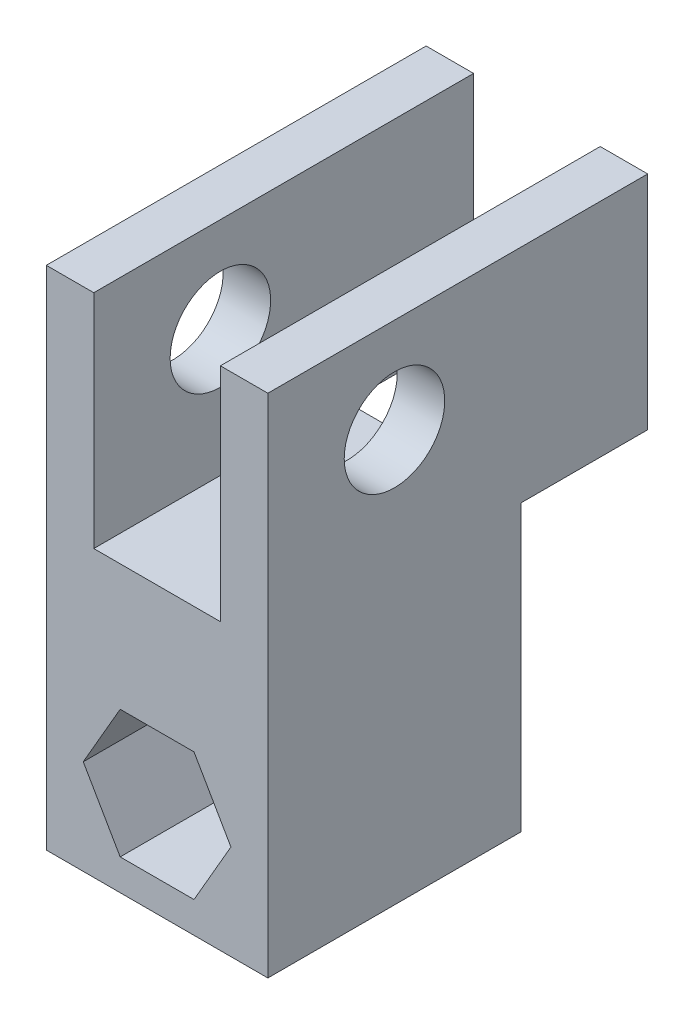
ISO-10303-21;
HEADER;
FILE_DESCRIPTION(('STEP AP214'),'2;1');
FILE_NAME('part.step','',(''),(''),'','','');
FILE_SCHEMA(('AUTOMOTIVE_DESIGN { 1 0 10303 214 1 1 1 1 }'));
ENDSEC;
DATA;
#1=APPLICATION_CONTEXT('core data for automotive mechanical design processes');
#2=APPLICATION_PROTOCOL_DEFINITION('international standard','automotive_design',2000,#1);
#3=PRODUCT_CONTEXT('',#1,'mechanical');
#4=PRODUCT('Part','Part','',(#3));
#5=PRODUCT_RELATED_PRODUCT_CATEGORY('part','',(#4));
#6=PRODUCT_DEFINITION_FORMATION('','',#4);
#7=PRODUCT_DEFINITION_CONTEXT('part definition',#1,'design');
#8=PRODUCT_DEFINITION('design','',#6,#7);
#9=PRODUCT_DEFINITION_SHAPE('','',#8);
#10=(LENGTH_UNIT() NAMED_UNIT(*) SI_UNIT(.MILLI.,.METRE.));
#11=(NAMED_UNIT(*) PLANE_ANGLE_UNIT() SI_UNIT($,.RADIAN.));
#12=(NAMED_UNIT(*) SI_UNIT($,.STERADIAN.) SOLID_ANGLE_UNIT());
#13=UNCERTAINTY_MEASURE_WITH_UNIT(LENGTH_MEASURE(1.E-05),#10,'distance_accuracy_value','');
#14=(GEOMETRIC_REPRESENTATION_CONTEXT(3) GLOBAL_UNCERTAINTY_ASSIGNED_CONTEXT((#13)) GLOBAL_UNIT_ASSIGNED_CONTEXT((#10,
#11,#12)) REPRESENTATION_CONTEXT('',''));
#15=CARTESIAN_POINT('',(0.,0.,0.));
#16=DIRECTION('',(0.,0.,1.));
#17=DIRECTION('',(1.,0.,0.));
#18=AXIS2_PLACEMENT_3D('',#15,#16,#17);
#19=CARTESIAN_POINT('',(0.,0.,0.));
#20=DIRECTION('',(0.,0.,1.));
#21=DIRECTION('',(1.,0.,0.));
#22=AXIS2_PLACEMENT_3D('',#19,#20,#21);
#23=PLANE('',#22);
#24=DIRECTION('',(0.5,0.866025403784439,0.));
#25=VECTOR('',#24,1.);
#26=CARTESIAN_POINT('',(3.70283595144767,3.11150000000001,0.));
#27=LINE('',#26,#25);
#28=CARTESIAN_POINT('',(3.70283595144767,3.11150000000001,0.));
#29=VERTEX_POINT('',#28);
#30=CARTESIAN_POINT('',(7.40567190289534,9.525,0.));
#31=VERTEX_POINT('',#30);
#32=EDGE_CURVE('E289',#29,#31,#27,.T.);
#33=ORIENTED_EDGE('',*,*,#32,.T.);
#34=DIRECTION('',(-0.5,0.866025403784439,0.));
#35=VECTOR('',#34,1.);
#36=CARTESIAN_POINT('',(7.40567190289534,9.525,0.));
#37=LINE('',#36,#35);
#38=CARTESIAN_POINT('',(3.70283595144767,15.9385,0.));
#39=VERTEX_POINT('',#38);
#40=EDGE_CURVE('E268',#31,#39,#37,.T.);
#41=ORIENTED_EDGE('',*,*,#40,.T.);
#42=DIRECTION('',(-1.,0.,0.));
#43=VECTOR('',#42,1.);
#44=CARTESIAN_POINT('',(3.70283595144767,15.9385,0.));
#45=LINE('',#44,#43);
#46=CARTESIAN_POINT('',(-3.70283595144766,15.9385,0.));
#47=VERTEX_POINT('',#46);
#48=EDGE_CURVE('E272',#39,#47,#45,.T.);
#49=ORIENTED_EDGE('',*,*,#48,.T.);
#50=DIRECTION('',(-0.5,-0.866025403784439,0.));
#51=VECTOR('',#50,1.);
#52=CARTESIAN_POINT('',(-3.70283595144766,15.9385,0.));
#53=LINE('',#52,#51);
#54=CARTESIAN_POINT('',(-7.40567190289533,9.525,0.));
#55=VERTEX_POINT('',#54);
#56=EDGE_CURVE('E277',#47,#55,#53,.T.);
#57=ORIENTED_EDGE('',*,*,#56,.T.);
#58=DIRECTION('',(0.5,-0.866025403784439,0.));
#59=VECTOR('',#58,1.);
#60=CARTESIAN_POINT('',(-7.40567190289533,9.525,0.));
#61=LINE('',#60,#59);
#62=CARTESIAN_POINT('',(-3.70283595144766,3.1115,0.));
#63=VERTEX_POINT('',#62);
#64=EDGE_CURVE('E281',#55,#63,#61,.T.);
#65=ORIENTED_EDGE('',*,*,#64,.T.);
#66=DIRECTION('',(1.,0.,0.));
#67=VECTOR('',#66,1.);
#68=CARTESIAN_POINT('',(-3.70283595144766,3.1115,0.));
#69=LINE('',#68,#67);
#70=EDGE_CURVE('E285',#63,#29,#69,.T.);
#71=ORIENTED_EDGE('',*,*,#70,.T.);
#72=EDGE_LOOP('',(#33,#41,#49,#57,#65,#71));
#73=FACE_BOUND('',#72,.T.);
#74=DIRECTION('',(-1.,0.,0.));
#75=VECTOR('',#74,1.);
#76=CARTESIAN_POINT('',(11.1125,28.575,0.));
#77=LINE('',#76,#75);
#78=CARTESIAN_POINT('',(11.1125,28.575,0.));
#79=VERTEX_POINT('',#78);
#80=CARTESIAN_POINT('',(6.35,28.575,0.));
#81=VERTEX_POINT('',#80);
#82=EDGE_CURVE('E64',#79,#81,#77,.T.);
#83=ORIENTED_EDGE('',*,*,#82,.F.);
#84=DIRECTION('',(0.,1.,0.));
#85=VECTOR('',#84,1.);
#86=CARTESIAN_POINT('',(11.1125,50.8,0.));
#87=LINE('',#86,#85);
#88=CARTESIAN_POINT('',(11.1125,0.,0.));
#89=VERTEX_POINT('',#88);
#90=EDGE_CURVE('E223',#89,#79,#87,.T.);
#91=ORIENTED_EDGE('',*,*,#90,.F.);
#92=DIRECTION('',(1.,0.,0.));
#93=VECTOR('',#92,1.);
#94=CARTESIAN_POINT('',(-11.1125,0.,0.));
#95=LINE('',#94,#93);
#96=CARTESIAN_POINT('',(-11.1125,0.,0.));
#97=VERTEX_POINT('',#96);
#98=EDGE_CURVE('E337',#97,#89,#95,.T.);
#99=ORIENTED_EDGE('',*,*,#98,.F.);
#100=DIRECTION('',(0.,-1.,0.));
#101=VECTOR('',#100,1.);
#102=CARTESIAN_POINT('',(-11.1125,0.,0.));
#103=LINE('',#102,#101);
#104=CARTESIAN_POINT('',(-11.1125,28.575,0.));
#105=VERTEX_POINT('',#104);
#106=EDGE_CURVE('E364',#105,#97,#103,.T.);
#107=ORIENTED_EDGE('',*,*,#106,.F.);
#108=DIRECTION('',(-1.,0.,0.));
#109=VECTOR('',#108,1.);
#110=CARTESIAN_POINT('',(-11.1125,28.575,0.));
#111=LINE('',#110,#109);
#112=CARTESIAN_POINT('',(-6.35000000000001,28.575,0.));
#113=VERTEX_POINT('',#112);
#114=EDGE_CURVE('E245',#113,#105,#111,.T.);
#115=ORIENTED_EDGE('',*,*,#114,.F.);
#116=DIRECTION('',(-1.,0.,0.));
#117=VECTOR('',#116,1.);
#118=CARTESIAN_POINT('',(-6.35000000000001,28.575,0.));
#119=LINE('',#118,#117);
#120=EDGE_CURVE('E360',#81,#113,#119,.T.);
#121=ORIENTED_EDGE('',*,*,#120,.F.);
#122=EDGE_LOOP('',(#83,#91,#99,#107,#115,#121));
#123=FACE_BOUND('',#122,.T.);
#124=ADVANCED_FACE('F47',(#73,#123),#23,.F.);
#125=CARTESIAN_POINT('',(11.1125,50.8,25.4));
#126=DIRECTION('',(-1.,0.,0.));
#127=DIRECTION('',(0.,-1.,0.));
#128=AXIS2_PLACEMENT_3D('',#125,#126,#127);
#129=PLANE('',#128);
#130=CARTESIAN_POINT('',(11.1125,41.275,12.7));
#131=DIRECTION('',(-1.,0.,0.));
#132=DIRECTION('',(0.,0.,1.));
#133=AXIS2_PLACEMENT_3D('',#130,#131,#132);
#134=CIRCLE('',#133,5.04189999999999);
#135=CARTESIAN_POINT('',(11.1125,41.275,17.7419));
#136=VERTEX_POINT('',#135);
#137=EDGE_CURVE('E230',#136,#136,#134,.T.);
#138=ORIENTED_EDGE('',*,*,#137,.T.);
#139=EDGE_LOOP('',(#138));
#140=FACE_BOUND('',#139,.T.);
#141=ORIENTED_EDGE('',*,*,#90,.T.);
#142=DIRECTION('',(0.,0.,1.));
#143=VECTOR('',#142,1.);
#144=CARTESIAN_POINT('',(11.1125,28.575,-12.7));
#145=LINE('',#144,#143);
#146=CARTESIAN_POINT('',(11.1125,28.575,-12.7));
#147=VERTEX_POINT('',#146);
#148=EDGE_CURVE('E203',#147,#79,#145,.T.);
#149=ORIENTED_EDGE('',*,*,#148,.F.);
#150=DIRECTION('',(0.,-1.,0.));
#151=VECTOR('',#150,1.);
#152=CARTESIAN_POINT('',(11.1125,50.8,-12.7));
#153=LINE('',#152,#151);
#154=CARTESIAN_POINT('',(11.1125,50.8,-12.7));
#155=VERTEX_POINT('',#154);
#156=EDGE_CURVE('E211',#155,#147,#153,.T.);
#157=ORIENTED_EDGE('',*,*,#156,.F.);
#158=DIRECTION('',(0.,0.,-1.));
#159=VECTOR('',#158,1.);
#160=CARTESIAN_POINT('',(11.1125,50.8,25.4));
#161=LINE('',#160,#159);
#162=CARTESIAN_POINT('',(11.1125,50.8,25.4));
#163=VERTEX_POINT('',#162);
#164=EDGE_CURVE('E11',#163,#155,#161,.T.);
#165=ORIENTED_EDGE('',*,*,#164,.F.);
#166=DIRECTION('',(0.,1.,0.));
#167=VECTOR('',#166,1.);
#168=CARTESIAN_POINT('',(11.1125,50.8,25.4));
#169=LINE('',#168,#167);
#170=CARTESIAN_POINT('',(11.1125,0.,25.4));
#171=VERTEX_POINT('',#170);
#172=EDGE_CURVE('E332',#171,#163,#169,.T.);
#173=ORIENTED_EDGE('',*,*,#172,.F.);
#174=DIRECTION('',(0.,0.,-1.));
#175=VECTOR('',#174,1.);
#176=CARTESIAN_POINT('',(11.1125,0.,25.4));
#177=LINE('',#176,#175);
#178=EDGE_CURVE('E358',#171,#89,#177,.T.);
#179=ORIENTED_EDGE('',*,*,#178,.T.);
#180=EDGE_LOOP('',(#141,#149,#157,#165,#173,#179));
#181=FACE_BOUND('',#180,.T.);
#182=ADVANCED_FACE('F49',(#140,#181),#129,.F.);
#183=CARTESIAN_POINT('',(6.34999999999999,50.8,25.4));
#184=DIRECTION('',(0.,-1.,0.));
#185=DIRECTION('',(1.,0.,0.));
#186=AXIS2_PLACEMENT_3D('',#183,#184,#185);
#187=PLANE('',#186);
#188=ORIENTED_EDGE('',*,*,#164,.T.);
#189=DIRECTION('',(1.,0.,0.));
#190=VECTOR('',#189,1.);
#191=CARTESIAN_POINT('',(11.1125,50.8,-12.7));
#192=LINE('',#191,#190);
#193=CARTESIAN_POINT('',(6.35,50.8,-12.7));
#194=VERTEX_POINT('',#193);
#195=EDGE_CURVE('E217',#194,#155,#192,.T.);
#196=ORIENTED_EDGE('',*,*,#195,.F.);
#197=DIRECTION('',(0.,0.,-1.));
#198=VECTOR('',#197,1.);
#199=CARTESIAN_POINT('',(6.34999999999999,50.8,25.4));
#200=LINE('',#199,#198);
#201=CARTESIAN_POINT('',(6.34999999999999,50.8,25.4));
#202=VERTEX_POINT('',#201);
#203=EDGE_CURVE('E57',#202,#194,#200,.T.);
#204=ORIENTED_EDGE('',*,*,#203,.F.);
#205=DIRECTION('',(-1.,0.,0.));
#206=VECTOR('',#205,1.);
#207=CARTESIAN_POINT('',(6.34999999999999,50.8,25.4));
#208=LINE('',#207,#206);
#209=EDGE_CURVE('E336',#163,#202,#208,.T.);
#210=ORIENTED_EDGE('',*,*,#209,.F.);
#211=EDGE_LOOP('',(#188,#196,#204,#210));
#212=FACE_BOUND('',#211,.T.);
#213=ADVANCED_FACE('F398',(#212),#187,.F.);
#214=CARTESIAN_POINT('',(6.35,28.575,25.4));
#215=DIRECTION('',(1.,0.,0.));
#216=DIRECTION('',(0.,1.,0.));
#217=AXIS2_PLACEMENT_3D('',#214,#215,#216);
#218=PLANE('',#217);
#219=CARTESIAN_POINT('',(6.35,41.275,12.7));
#220=DIRECTION('',(1.,0.,0.));
#221=DIRECTION('',(0.,1.,0.));
#222=AXIS2_PLACEMENT_3D('',#219,#220,#221);
#223=CIRCLE('',#222,5.0419);
#224=CARTESIAN_POINT('',(6.35,46.3169,12.7));
#225=VERTEX_POINT('',#224);
#226=EDGE_CURVE('E264',#225,#225,#223,.T.);
#227=ORIENTED_EDGE('',*,*,#226,.T.);
#228=EDGE_LOOP('',(#227));
#229=FACE_BOUND('',#228,.T.);
#230=ORIENTED_EDGE('',*,*,#203,.T.);
#231=DIRECTION('',(0.,1.,0.));
#232=VECTOR('',#231,1.);
#233=CARTESIAN_POINT('',(6.35,50.8,-12.7));
#234=LINE('',#233,#232);
#235=CARTESIAN_POINT('',(6.35,28.575,-12.7));
#236=VERTEX_POINT('',#235);
#237=EDGE_CURVE('E210',#236,#194,#234,.T.);
#238=ORIENTED_EDGE('',*,*,#237,.F.);
#239=DIRECTION('',(0.,0.,1.));
#240=VECTOR('',#239,1.);
#241=CARTESIAN_POINT('',(6.35,28.575,-12.7));
#242=LINE('',#241,#240);
#243=EDGE_CURVE('E205',#236,#81,#242,.T.);
#244=ORIENTED_EDGE('',*,*,#243,.T.);
#245=DIRECTION('',(0.,0.,-1.));
#246=VECTOR('',#245,1.);
#247=CARTESIAN_POINT('',(6.35,28.575,25.4));
#248=LINE('',#247,#246);
#249=CARTESIAN_POINT('',(6.35,28.575,25.4));
#250=VERTEX_POINT('',#249);
#251=EDGE_CURVE('E385',#250,#81,#248,.T.);
#252=ORIENTED_EDGE('',*,*,#251,.F.);
#253=DIRECTION('',(0.,-1.,0.));
#254=VECTOR('',#253,1.);
#255=CARTESIAN_POINT('',(6.35,28.575,25.4));
#256=LINE('',#255,#254);
#257=EDGE_CURVE('E340',#202,#250,#256,.T.);
#258=ORIENTED_EDGE('',*,*,#257,.F.);
#259=EDGE_LOOP('',(#230,#238,#244,#252,#258));
#260=FACE_BOUND('',#259,.T.);
#261=ADVANCED_FACE('F393',(#229,#260),#218,.F.);
#262=CARTESIAN_POINT('',(-6.35000000000001,28.575,25.4));
#263=DIRECTION('',(0.,-1.,0.));
#264=DIRECTION('',(1.,0.,0.));
#265=AXIS2_PLACEMENT_3D('',#262,#263,#264);
#266=PLANE('',#265);
#267=ORIENTED_EDGE('',*,*,#120,.T.);
#268=DIRECTION('',(0.,0.,-1.));
#269=VECTOR('',#268,1.);
#270=CARTESIAN_POINT('',(-6.35000000000001,28.575,25.4));
#271=LINE('',#270,#269);
#272=CARTESIAN_POINT('',(-6.35000000000001,28.575,25.4));
#273=VERTEX_POINT('',#272);
#274=EDGE_CURVE('E381',#273,#113,#271,.T.);
#275=ORIENTED_EDGE('',*,*,#274,.F.);
#276=DIRECTION('',(-1.,0.,0.));
#277=VECTOR('',#276,1.);
#278=CARTESIAN_POINT('',(-6.35000000000001,28.575,25.4));
#279=LINE('',#278,#277);
#280=EDGE_CURVE('E343',#250,#273,#279,.T.);
#281=ORIENTED_EDGE('',*,*,#280,.F.);
#282=ORIENTED_EDGE('',*,*,#251,.T.);
#283=EDGE_LOOP('',(#267,#275,#281,#282));
#284=FACE_BOUND('',#283,.T.);
#285=ADVANCED_FACE('F405',(#284),#266,.F.);
#286=CARTESIAN_POINT('',(-6.35000000000001,50.8,25.4));
#287=DIRECTION('',(-1.,0.,0.));
#288=DIRECTION('',(0.,-1.,0.));
#289=AXIS2_PLACEMENT_3D('',#286,#287,#288);
#290=PLANE('',#289);
#291=CARTESIAN_POINT('',(-6.35000000000001,41.275,12.7));
#292=DIRECTION('',(-1.,0.,0.));
#293=DIRECTION('',(0.,-1.,0.));
#294=AXIS2_PLACEMENT_3D('',#291,#292,#293);
#295=CIRCLE('',#294,5.0419);
#296=CARTESIAN_POINT('',(-6.35000000000001,36.2331,12.7));
#297=VERTEX_POINT('',#296);
#298=EDGE_CURVE('E51',#297,#297,#295,.T.);
#299=ORIENTED_EDGE('',*,*,#298,.T.);
#300=EDGE_LOOP('',(#299));
#301=FACE_BOUND('',#300,.T.);
#302=ORIENTED_EDGE('',*,*,#274,.T.);
#303=DIRECTION('',(0.,0.,1.));
#304=VECTOR('',#303,1.);
#305=CARTESIAN_POINT('',(-6.35000000000001,28.575,-12.7));
#306=LINE('',#305,#304);
#307=CARTESIAN_POINT('',(-6.35000000000001,28.575,-12.7));
#308=VERTEX_POINT('',#307);
#309=EDGE_CURVE('E236',#308,#113,#306,.T.);
#310=ORIENTED_EDGE('',*,*,#309,.F.);
#311=DIRECTION('',(0.,-1.,0.));
#312=VECTOR('',#311,1.);
#313=CARTESIAN_POINT('',(-6.35,50.8,-12.7));
#314=LINE('',#313,#312);
#315=CARTESIAN_POINT('',(-6.35,50.8,-12.7));
#316=VERTEX_POINT('',#315);
#317=EDGE_CURVE('E251',#316,#308,#314,.T.);
#318=ORIENTED_EDGE('',*,*,#317,.F.);
#319=DIRECTION('',(0.,0.,-1.));
#320=VECTOR('',#319,1.);
#321=CARTESIAN_POINT('',(-6.35000000000001,50.8,25.4));
#322=LINE('',#321,#320);
#323=CARTESIAN_POINT('',(-6.35000000000001,50.8,25.4));
#324=VERTEX_POINT('',#323);
#325=EDGE_CURVE('E378',#324,#316,#322,.T.);
#326=ORIENTED_EDGE('',*,*,#325,.F.);
#327=DIRECTION('',(0.,1.,0.));
#328=VECTOR('',#327,1.);
#329=CARTESIAN_POINT('',(-6.35000000000001,50.8,25.4));
#330=LINE('',#329,#328);
#331=EDGE_CURVE('E346',#273,#324,#330,.T.);
#332=ORIENTED_EDGE('',*,*,#331,.F.);
#333=EDGE_LOOP('',(#302,#310,#318,#326,#332));
#334=FACE_BOUND('',#333,.T.);
#335=ADVANCED_FACE('F427',(#301,#334),#290,.F.);
#336=CARTESIAN_POINT('',(-11.1125,50.8,25.4));
#337=DIRECTION('',(0.,-1.,0.));
#338=DIRECTION('',(0.,0.,-1.));
#339=AXIS2_PLACEMENT_3D('',#336,#337,#338);
#340=PLANE('',#339);
#341=ORIENTED_EDGE('',*,*,#325,.T.);
#342=DIRECTION('',(1.,0.,0.));
#343=VECTOR('',#342,1.);
#344=CARTESIAN_POINT('',(-11.1125,50.8,-12.7));
#345=LINE('',#344,#343);
#346=CARTESIAN_POINT('',(-11.1125,50.8,-12.7));
#347=VERTEX_POINT('',#346);
#348=EDGE_CURVE('E254',#347,#316,#345,.T.);
#349=ORIENTED_EDGE('',*,*,#348,.F.);
#350=DIRECTION('',(0.,0.,-1.));
#351=VECTOR('',#350,1.);
#352=CARTESIAN_POINT('',(-11.1125,50.8,25.4));
#353=LINE('',#352,#351);
#354=CARTESIAN_POINT('',(-11.1125,50.8,25.4));
#355=VERTEX_POINT('',#354);
#356=EDGE_CURVE('E375',#355,#347,#353,.T.);
#357=ORIENTED_EDGE('',*,*,#356,.F.);
#358=DIRECTION('',(-1.,0.,0.));
#359=VECTOR('',#358,1.);
#360=CARTESIAN_POINT('',(-11.1125,50.8,25.4));
#361=LINE('',#360,#359);
#362=EDGE_CURVE('E349',#324,#355,#361,.T.);
#363=ORIENTED_EDGE('',*,*,#362,.F.);
#364=EDGE_LOOP('',(#341,#349,#357,#363));
#365=FACE_BOUND('',#364,.T.);
#366=ADVANCED_FACE('F433',(#365),#340,.F.);
#367=CARTESIAN_POINT('',(-11.1125,0.,25.4));
#368=DIRECTION('',(1.,0.,0.));
#369=DIRECTION('',(0.,0.,-1.));
#370=AXIS2_PLACEMENT_3D('',#367,#368,#369);
#371=PLANE('',#370);
#372=CARTESIAN_POINT('',(-11.1125,41.275,12.7));
#373=DIRECTION('',(-1.,0.,0.));
#374=DIRECTION('',(0.,0.,1.));
#375=AXIS2_PLACEMENT_3D('',#372,#373,#374);
#376=CIRCLE('',#375,5.0419);
#377=CARTESIAN_POINT('',(-11.1125,41.275,17.7419));
#378=VERTEX_POINT('',#377);
#379=EDGE_CURVE('E225',#378,#378,#376,.T.);
#380=ORIENTED_EDGE('',*,*,#379,.F.);
#381=EDGE_LOOP('',(#380));
#382=FACE_BOUND('',#381,.T.);
#383=ORIENTED_EDGE('',*,*,#356,.T.);
#384=DIRECTION('',(0.,1.,0.));
#385=VECTOR('',#384,1.);
#386=CARTESIAN_POINT('',(-11.1125,50.8,-12.7));
#387=LINE('',#386,#385);
#388=CARTESIAN_POINT('',(-11.1125,28.575,-12.7));
#389=VERTEX_POINT('',#388);
#390=EDGE_CURVE('E248',#389,#347,#387,.T.);
#391=ORIENTED_EDGE('',*,*,#390,.F.);
#392=DIRECTION('',(0.,0.,1.));
#393=VECTOR('',#392,1.);
#394=CARTESIAN_POINT('',(-11.1125,28.575,-12.7));
#395=LINE('',#394,#393);
#396=EDGE_CURVE('E240',#389,#105,#395,.T.);
#397=ORIENTED_EDGE('',*,*,#396,.T.);
#398=ORIENTED_EDGE('',*,*,#106,.T.);
#399=DIRECTION('',(0.,0.,-1.));
#400=VECTOR('',#399,1.);
#401=CARTESIAN_POINT('',(-11.1125,0.,25.4));
#402=LINE('',#401,#400);
#403=CARTESIAN_POINT('',(-11.1125,0.,25.4));
#404=VERTEX_POINT('',#403);
#405=EDGE_CURVE('E371',#404,#97,#402,.T.);
#406=ORIENTED_EDGE('',*,*,#405,.F.);
#407=DIRECTION('',(0.,-1.,0.));
#408=VECTOR('',#407,1.);
#409=CARTESIAN_POINT('',(-11.1125,0.,25.4));
#410=LINE('',#409,#408);
#411=EDGE_CURVE('E352',#355,#404,#410,.T.);
#412=ORIENTED_EDGE('',*,*,#411,.F.);
#413=EDGE_LOOP('',(#383,#391,#397,#398,#406,#412));
#414=FACE_BOUND('',#413,.T.);
#415=ADVANCED_FACE('F419',(#382,#414),#371,.F.);
#416=CARTESIAN_POINT('',(-11.1125,0.,25.4));
#417=DIRECTION('',(0.,1.,0.));
#418=DIRECTION('',(-1.,0.,0.));
#419=AXIS2_PLACEMENT_3D('',#416,#417,#418);
#420=PLANE('',#419);
#421=ORIENTED_EDGE('',*,*,#98,.T.);
#422=ORIENTED_EDGE('',*,*,#178,.F.);
#423=DIRECTION('',(1.,0.,0.));
#424=VECTOR('',#423,1.);
#425=CARTESIAN_POINT('',(-11.1125,0.,25.4));
#426=LINE('',#425,#424);
#427=EDGE_CURVE('E355',#404,#171,#426,.T.);
#428=ORIENTED_EDGE('',*,*,#427,.F.);
#429=ORIENTED_EDGE('',*,*,#405,.T.);
#430=EDGE_LOOP('',(#421,#422,#428,#429));
#431=FACE_BOUND('',#430,.T.);
#432=ADVANCED_FACE('F415',(#431),#420,.F.);
#433=CARTESIAN_POINT('',(0.,0.,25.4));
#434=DIRECTION('',(0.,0.,1.));
#435=DIRECTION('',(1.,0.,0.));
#436=AXIS2_PLACEMENT_3D('',#433,#434,#435);
#437=PLANE('',#436);
#438=DIRECTION('',(-0.5,0.866025403784439,0.));
#439=VECTOR('',#438,1.);
#440=CARTESIAN_POINT('',(7.40567190289534,9.525,25.4));
#441=LINE('',#440,#439);
#442=CARTESIAN_POINT('',(7.40567190289534,9.525,25.4));
#443=VERTEX_POINT('',#442);
#444=CARTESIAN_POINT('',(3.70283595144767,15.9385,25.4));
#445=VERTEX_POINT('',#444);
#446=EDGE_CURVE('E75',#443,#445,#441,.T.);
#447=ORIENTED_EDGE('',*,*,#446,.F.);
#448=DIRECTION('',(0.5,0.866025403784439,0.));
#449=VECTOR('',#448,1.);
#450=CARTESIAN_POINT('',(3.70283595144767,3.11150000000001,25.4));
#451=LINE('',#450,#449);
#452=CARTESIAN_POINT('',(3.70283595144767,3.11150000000001,25.4));
#453=VERTEX_POINT('',#452);
#454=EDGE_CURVE('E273',#453,#443,#451,.T.);
#455=ORIENTED_EDGE('',*,*,#454,.F.);
#456=DIRECTION('',(1.,0.,0.));
#457=VECTOR('',#456,1.);
#458=CARTESIAN_POINT('',(-3.70283595144766,3.1115,25.4));
#459=LINE('',#458,#457);
#460=CARTESIAN_POINT('',(-3.70283595144766,3.1115,25.4));
#461=VERTEX_POINT('',#460);
#462=EDGE_CURVE('E308',#461,#453,#459,.T.);
#463=ORIENTED_EDGE('',*,*,#462,.F.);
#464=DIRECTION('',(0.5,-0.866025403784439,0.));
#465=VECTOR('',#464,1.);
#466=CARTESIAN_POINT('',(-7.40567190289533,9.525,25.4));
#467=LINE('',#466,#465);
#468=CARTESIAN_POINT('',(-7.40567190289533,9.525,25.4));
#469=VERTEX_POINT('',#468);
#470=EDGE_CURVE('E304',#469,#461,#467,.T.);
#471=ORIENTED_EDGE('',*,*,#470,.F.);
#472=DIRECTION('',(-0.5,-0.866025403784439,0.));
#473=VECTOR('',#472,1.);
#474=CARTESIAN_POINT('',(-3.70283595144766,15.9385,25.4));
#475=LINE('',#474,#473);
#476=CARTESIAN_POINT('',(-3.70283595144766,15.9385,25.4));
#477=VERTEX_POINT('',#476);
#478=EDGE_CURVE('E300',#477,#469,#475,.T.);
#479=ORIENTED_EDGE('',*,*,#478,.F.);
#480=DIRECTION('',(-1.,0.,0.));
#481=VECTOR('',#480,1.);
#482=CARTESIAN_POINT('',(3.70283595144767,15.9385,25.4));
#483=LINE('',#482,#481);
#484=EDGE_CURVE('E296',#445,#477,#483,.T.);
#485=ORIENTED_EDGE('',*,*,#484,.F.);
#486=EDGE_LOOP('',(#447,#455,#463,#471,#479,#485));
#487=FACE_BOUND('',#486,.T.);
#488=ORIENTED_EDGE('',*,*,#172,.T.);
#489=ORIENTED_EDGE('',*,*,#209,.T.);
#490=ORIENTED_EDGE('',*,*,#257,.T.);
#491=ORIENTED_EDGE('',*,*,#280,.T.);
#492=ORIENTED_EDGE('',*,*,#331,.T.);
#493=ORIENTED_EDGE('',*,*,#362,.T.);
#494=ORIENTED_EDGE('',*,*,#411,.T.);
#495=ORIENTED_EDGE('',*,*,#427,.T.);
#496=EDGE_LOOP('',(#488,#489,#490,#491,#492,#493,#494,#495));
#497=FACE_BOUND('',#496,.T.);
#498=ADVANCED_FACE('F408',(#487,#497),#437,.T.);
#499=CARTESIAN_POINT('',(7.40567190289534,9.525,0.));
#500=DIRECTION('',(0.866025403784439,0.5,0.));
#501=DIRECTION('',(-0.5,0.866025403784439,0.));
#502=AXIS2_PLACEMENT_3D('',#499,#500,#501);
#503=PLANE('',#502);
#504=ORIENTED_EDGE('',*,*,#446,.T.);
#505=DIRECTION('',(0.,0.,1.));
#506=VECTOR('',#505,1.);
#507=CARTESIAN_POINT('',(3.70283595144767,15.9385,0.));
#508=LINE('',#507,#506);
#509=EDGE_CURVE('E293',#39,#445,#508,.T.);
#510=ORIENTED_EDGE('',*,*,#509,.F.);
#511=ORIENTED_EDGE('',*,*,#40,.F.);
#512=DIRECTION('',(0.,0.,1.));
#513=VECTOR('',#512,1.);
#514=CARTESIAN_POINT('',(7.40567190289534,9.525,0.));
#515=LINE('',#514,#513);
#516=EDGE_CURVE('E315',#31,#443,#515,.T.);
#517=ORIENTED_EDGE('',*,*,#516,.T.);
#518=EDGE_LOOP('',(#504,#510,#511,#517));
#519=FACE_BOUND('',#518,.T.);
#520=ADVANCED_FACE('F534',(#519),#503,.F.);
#521=CARTESIAN_POINT('',(3.70283595144767,3.11150000000001,0.));
#522=DIRECTION('',(0.866025403784439,-0.5,0.));
#523=DIRECTION('',(0.5,0.866025403784439,0.));
#524=AXIS2_PLACEMENT_3D('',#521,#522,#523);
#525=PLANE('',#524);
#526=ORIENTED_EDGE('',*,*,#454,.T.);
#527=ORIENTED_EDGE('',*,*,#516,.F.);
#528=ORIENTED_EDGE('',*,*,#32,.F.);
#529=DIRECTION('',(0.,0.,1.));
#530=VECTOR('',#529,1.);
#531=CARTESIAN_POINT('',(3.70283595144767,3.11150000000001,0.));
#532=LINE('',#531,#530);
#533=EDGE_CURVE('E318',#29,#453,#532,.T.);
#534=ORIENTED_EDGE('',*,*,#533,.T.);
#535=EDGE_LOOP('',(#526,#527,#528,#534));
#536=FACE_BOUND('',#535,.T.);
#537=ADVANCED_FACE('F547',(#536),#525,.F.);
#538=CARTESIAN_POINT('',(-3.70283595144766,3.1115,0.));
#539=DIRECTION('',(0.,-1.,0.));
#540=DIRECTION('',(1.,0.,0.));
#541=AXIS2_PLACEMENT_3D('',#538,#539,#540);
#542=PLANE('',#541);
#543=ORIENTED_EDGE('',*,*,#462,.T.);
#544=ORIENTED_EDGE('',*,*,#533,.F.);
#545=ORIENTED_EDGE('',*,*,#70,.F.);
#546=DIRECTION('',(0.,0.,1.));
#547=VECTOR('',#546,1.);
#548=CARTESIAN_POINT('',(-3.70283595144766,3.1115,0.));
#549=LINE('',#548,#547);
#550=EDGE_CURVE('E321',#63,#461,#549,.T.);
#551=ORIENTED_EDGE('',*,*,#550,.T.);
#552=EDGE_LOOP('',(#543,#544,#545,#551));
#553=FACE_BOUND('',#552,.T.);
#554=ADVANCED_FACE('F554',(#553),#542,.F.);
#555=CARTESIAN_POINT('',(-7.40567190289533,9.525,0.));
#556=DIRECTION('',(-0.866025403784439,-0.5,0.));
#557=DIRECTION('',(0.5,-0.866025403784439,0.));
#558=AXIS2_PLACEMENT_3D('',#555,#556,#557);
#559=PLANE('',#558);
#560=ORIENTED_EDGE('',*,*,#470,.T.);
#561=ORIENTED_EDGE('',*,*,#550,.F.);
#562=ORIENTED_EDGE('',*,*,#64,.F.);
#563=DIRECTION('',(0.,0.,1.));
#564=VECTOR('',#563,1.);
#565=CARTESIAN_POINT('',(-7.40567190289533,9.525,0.));
#566=LINE('',#565,#564);
#567=EDGE_CURVE('E324',#55,#469,#566,.T.);
#568=ORIENTED_EDGE('',*,*,#567,.T.);
#569=EDGE_LOOP('',(#560,#561,#562,#568));
#570=FACE_BOUND('',#569,.T.);
#571=ADVANCED_FACE('F563',(#570),#559,.F.);
#572=CARTESIAN_POINT('',(-3.70283595144766,15.9385,0.));
#573=DIRECTION('',(-0.866025403784439,0.5,0.));
#574=DIRECTION('',(-0.5,-0.866025403784439,0.));
#575=AXIS2_PLACEMENT_3D('',#572,#573,#574);
#576=PLANE('',#575);
#577=ORIENTED_EDGE('',*,*,#478,.T.);
#578=ORIENTED_EDGE('',*,*,#567,.F.);
#579=ORIENTED_EDGE('',*,*,#56,.F.);
#580=DIRECTION('',(0.,0.,1.));
#581=VECTOR('',#580,1.);
#582=CARTESIAN_POINT('',(-3.70283595144766,15.9385,0.));
#583=LINE('',#582,#581);
#584=EDGE_CURVE('E327',#47,#477,#583,.T.);
#585=ORIENTED_EDGE('',*,*,#584,.T.);
#586=EDGE_LOOP('',(#577,#578,#579,#585));
#587=FACE_BOUND('',#586,.T.);
#588=ADVANCED_FACE('F572',(#587),#576,.F.);
#589=CARTESIAN_POINT('',(3.70283595144767,15.9385,0.));
#590=DIRECTION('',(0.,1.,0.));
#591=DIRECTION('',(0.,0.,1.));
#592=AXIS2_PLACEMENT_3D('',#589,#590,#591);
#593=PLANE('',#592);
#594=ORIENTED_EDGE('',*,*,#484,.T.);
#595=ORIENTED_EDGE('',*,*,#584,.F.);
#596=ORIENTED_EDGE('',*,*,#48,.F.);
#597=ORIENTED_EDGE('',*,*,#509,.T.);
#598=EDGE_LOOP('',(#594,#595,#596,#597));
#599=FACE_BOUND('',#598,.T.);
#600=ADVANCED_FACE('F581',(#599),#593,.F.);
#601=CARTESIAN_POINT('',(-11.1125,41.275,12.7));
#602=DIRECTION('',(-1.,0.,0.));
#603=DIRECTION('',(0.,0.,1.));
#604=AXIS2_PLACEMENT_3D('',#601,#602,#603);
#605=CYLINDRICAL_SURFACE('',#604,5.0419);
#606=ORIENTED_EDGE('',*,*,#379,.T.);
#607=EDGE_LOOP('',(#606));
#608=FACE_BOUND('',#607,.T.);
#609=ORIENTED_EDGE('',*,*,#298,.F.);
#610=EDGE_LOOP('',(#609));
#611=FACE_BOUND('',#610,.T.);
#612=ADVANCED_FACE('F590',(#608,#611),#605,.F.);
#613=ORIENTED_EDGE('',*,*,#137,.F.);
#614=EDGE_LOOP('',(#613));
#615=FACE_BOUND('',#614,.T.);
#616=ORIENTED_EDGE('',*,*,#226,.F.);
#617=EDGE_LOOP('',(#616));
#618=FACE_BOUND('',#617,.T.);
#619=ADVANCED_FACE('F443',(#615,#618),#605,.F.);
#620=CARTESIAN_POINT('',(-11.1125,28.575,-12.7));
#621=DIRECTION('',(0.,1.,0.));
#622=DIRECTION('',(0.,0.,1.));
#623=AXIS2_PLACEMENT_3D('',#620,#621,#622);
#624=PLANE('',#623);
#625=ORIENTED_EDGE('',*,*,#114,.T.);
#626=ORIENTED_EDGE('',*,*,#396,.F.);
#627=DIRECTION('',(-1.,0.,0.));
#628=VECTOR('',#627,1.);
#629=CARTESIAN_POINT('',(-11.1125,28.575,-12.7));
#630=LINE('',#629,#628);
#631=EDGE_CURVE('E244',#308,#389,#630,.T.);
#632=ORIENTED_EDGE('',*,*,#631,.F.);
#633=ORIENTED_EDGE('',*,*,#309,.T.);
#634=EDGE_LOOP('',(#625,#626,#632,#633));
#635=FACE_BOUND('',#634,.T.);
#636=ADVANCED_FACE('F424',(#635),#624,.F.);
#637=CARTESIAN_POINT('',(0.,0.,-12.7));
#638=DIRECTION('',(0.,0.,1.));
#639=DIRECTION('',(1.,0.,0.));
#640=AXIS2_PLACEMENT_3D('',#637,#638,#639);
#641=PLANE('',#640);
#642=ORIENTED_EDGE('',*,*,#390,.T.);
#643=ORIENTED_EDGE('',*,*,#348,.T.);
#644=ORIENTED_EDGE('',*,*,#317,.T.);
#645=ORIENTED_EDGE('',*,*,#631,.T.);
#646=EDGE_LOOP('',(#642,#643,#644,#645));
#647=FACE_BOUND('',#646,.T.);
#648=ADVANCED_FACE('F435',(#647),#641,.F.);
#649=CARTESIAN_POINT('',(11.1125,28.575,-12.7));
#650=DIRECTION('',(0.,1.,0.));
#651=DIRECTION('',(0.,0.,1.));
#652=AXIS2_PLACEMENT_3D('',#649,#650,#651);
#653=PLANE('',#652);
#654=ORIENTED_EDGE('',*,*,#82,.T.);
#655=ORIENTED_EDGE('',*,*,#243,.F.);
#656=DIRECTION('',(-1.,0.,0.));
#657=VECTOR('',#656,1.);
#658=CARTESIAN_POINT('',(11.1125,28.575,-12.7));
#659=LINE('',#658,#657);
#660=EDGE_CURVE('E199',#147,#236,#659,.T.);
#661=ORIENTED_EDGE('',*,*,#660,.F.);
#662=ORIENTED_EDGE('',*,*,#148,.T.);
#663=EDGE_LOOP('',(#654,#655,#661,#662));
#664=FACE_BOUND('',#663,.T.);
#665=ADVANCED_FACE('F201',(#664),#653,.F.);
#666=CARTESIAN_POINT('',(0.,0.,-12.7));
#667=DIRECTION('',(0.,0.,-1.));
#668=DIRECTION('',(-1.,0.,0.));
#669=AXIS2_PLACEMENT_3D('',#666,#667,#668);
#670=PLANE('',#669);
#671=ORIENTED_EDGE('',*,*,#156,.T.);
#672=ORIENTED_EDGE('',*,*,#660,.T.);
#673=ORIENTED_EDGE('',*,*,#237,.T.);
#674=ORIENTED_EDGE('',*,*,#195,.T.);
#675=EDGE_LOOP('',(#671,#672,#673,#674));
#676=FACE_BOUND('',#675,.T.);
#677=ADVANCED_FACE('F215',(#676),#670,.T.);
#678=CLOSED_SHELL('',(#124,#182,#213,#261,#285,#335,#366,#415,#432,#498,#520,#537,#554,#571,
#588,#600,#612,#619,#636,#648,#665,#677));
#679=MANIFOLD_SOLID_BREP('B2',#678);
#680=ADVANCED_BREP_SHAPE_REPRESENTATION('',(#18,#679),#14);
#681=SHAPE_DEFINITION_REPRESENTATION(#9,#680);
ENDSEC;
END-ISO-10303-21;
